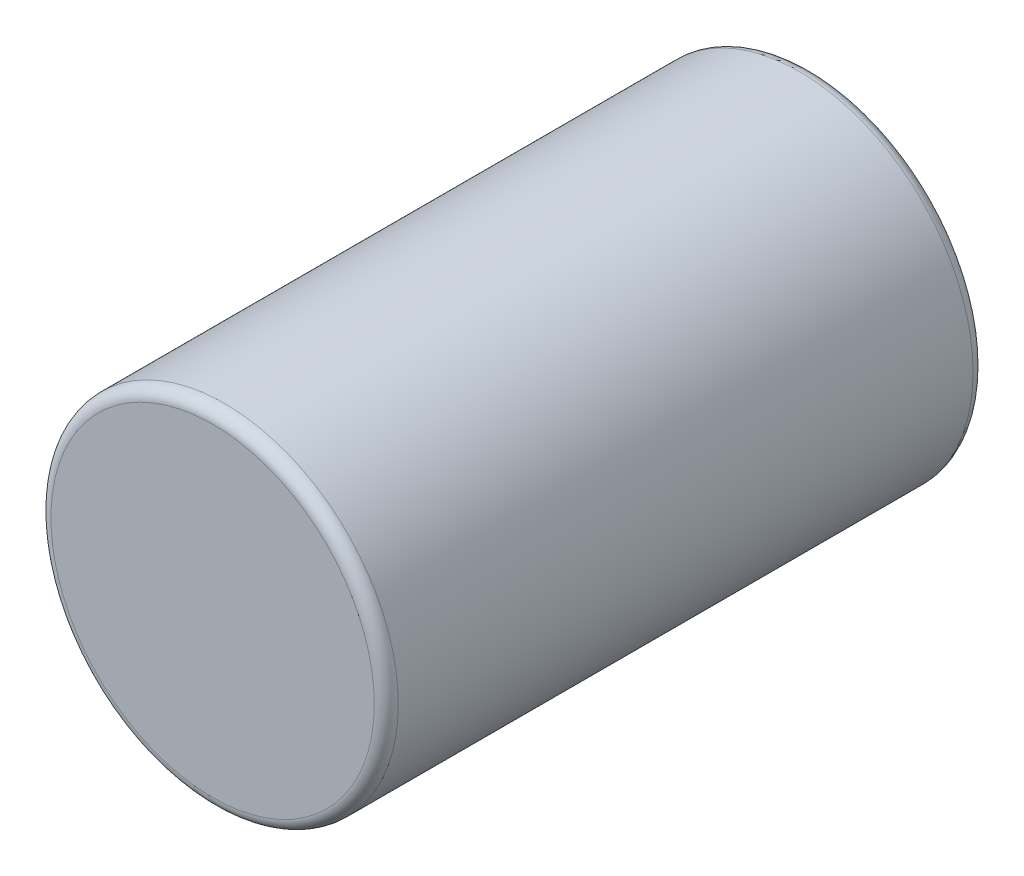
ISO-10303-21;
HEADER;
FILE_DESCRIPTION(('STEP AP214'),'2;1');
FILE_NAME('part.step','',(''),(''),'','','');
FILE_SCHEMA(('AUTOMOTIVE_DESIGN { 1 0 10303 214 1 1 1 1 }'));
ENDSEC;
DATA;
#1=APPLICATION_CONTEXT('core data for automotive mechanical design processes');
#2=APPLICATION_PROTOCOL_DEFINITION('international standard','automotive_design',2000,#1);
#3=PRODUCT_CONTEXT('',#1,'mechanical');
#4=PRODUCT('Part','Part','',(#3));
#5=PRODUCT_RELATED_PRODUCT_CATEGORY('part','',(#4));
#6=PRODUCT_DEFINITION_FORMATION('','',#4);
#7=PRODUCT_DEFINITION_CONTEXT('part definition',#1,'design');
#8=PRODUCT_DEFINITION('design','',#6,#7);
#9=PRODUCT_DEFINITION_SHAPE('','',#8);
#10=(LENGTH_UNIT() NAMED_UNIT(*) SI_UNIT(.MILLI.,.METRE.));
#11=(NAMED_UNIT(*) PLANE_ANGLE_UNIT() SI_UNIT($,.RADIAN.));
#12=(NAMED_UNIT(*) SI_UNIT($,.STERADIAN.) SOLID_ANGLE_UNIT());
#13=UNCERTAINTY_MEASURE_WITH_UNIT(LENGTH_MEASURE(1.E-05),#10,'distance_accuracy_value','');
#14=(GEOMETRIC_REPRESENTATION_CONTEXT(3) GLOBAL_UNCERTAINTY_ASSIGNED_CONTEXT((#13)) GLOBAL_UNIT_ASSIGNED_CONTEXT((#10,
#11,#12)) REPRESENTATION_CONTEXT('',''));
#15=CARTESIAN_POINT('',(0.,0.,0.));
#16=DIRECTION('',(0.,0.,1.));
#17=DIRECTION('',(1.,0.,0.));
#18=AXIS2_PLACEMENT_3D('',#15,#16,#17);
#19=CARTESIAN_POINT('',(0.,0.,2.5));
#20=DIRECTION('',(0.,0.,-1.));
#21=DIRECTION('',(-1.,0.,0.));
#22=AXIS2_PLACEMENT_3D('',#19,#20,#21);
#23=CYLINDRICAL_SURFACE('',#22,0.725);
#24=CARTESIAN_POINT('',(0.,0.,0.0500000000000001));
#25=DIRECTION('',(0.,0.,1.));
#26=DIRECTION('',(1.,0.,0.));
#27=AXIS2_PLACEMENT_3D('',#24,#25,#26);
#28=CIRCLE('',#27,0.725);
#29=CARTESIAN_POINT('',(0.725,0.,0.0500000000000001));
#30=VERTEX_POINT('',#29);
#31=EDGE_CURVE('E44',#30,#30,#28,.T.);
#32=ORIENTED_EDGE('',*,*,#31,.T.);
#33=EDGE_LOOP('',(#32));
#34=FACE_BOUND('',#33,.T.);
#35=CARTESIAN_POINT('',(0.,0.,2.45));
#36=DIRECTION('',(0.,0.,1.));
#37=DIRECTION('',(1.,0.,0.));
#38=AXIS2_PLACEMENT_3D('',#35,#36,#37);
#39=CIRCLE('',#38,0.725);
#40=CARTESIAN_POINT('',(0.725,0.,2.45));
#41=VERTEX_POINT('',#40);
#42=EDGE_CURVE('E48',#41,#41,#39,.F.);
#43=ORIENTED_EDGE('',*,*,#42,.T.);
#44=EDGE_LOOP('',(#43));
#45=FACE_BOUND('',#44,.T.);
#46=ADVANCED_FACE('F33',(#34,#45),#23,.T.);
#47=CARTESIAN_POINT('',(0.,0.,2.5));
#48=DIRECTION('',(0.,0.,1.));
#49=DIRECTION('',(1.,0.,0.));
#50=AXIS2_PLACEMENT_3D('',#47,#48,#49);
#51=PLANE('',#50);
#52=CARTESIAN_POINT('',(0.,0.,2.5));
#53=DIRECTION('',(0.,0.,1.));
#54=DIRECTION('',(1.,0.,0.));
#55=AXIS2_PLACEMENT_3D('',#52,#53,#54);
#56=CIRCLE('',#55,0.675);
#57=CARTESIAN_POINT('',(0.675,0.,2.5));
#58=VERTEX_POINT('',#57);
#59=EDGE_CURVE('E10',#58,#58,#56,.T.);
#60=ORIENTED_EDGE('',*,*,#59,.T.);
#61=EDGE_LOOP('',(#60));
#62=FACE_BOUND('',#61,.T.);
#63=ADVANCED_FACE('F64',(#62),#51,.T.);
#64=CARTESIAN_POINT('',(0.,0.,0.));
#65=DIRECTION('',(0.,0.,1.));
#66=DIRECTION('',(1.,0.,0.));
#67=AXIS2_PLACEMENT_3D('',#64,#65,#66);
#68=PLANE('',#67);
#69=CARTESIAN_POINT('',(0.,0.,0.));
#70=DIRECTION('',(0.,0.,1.));
#71=DIRECTION('',(1.,0.,0.));
#72=AXIS2_PLACEMENT_3D('',#69,#70,#71);
#73=CIRCLE('',#72,0.675);
#74=CARTESIAN_POINT('',(0.675,0.,0.));
#75=VERTEX_POINT('',#74);
#76=EDGE_CURVE('E40',#75,#75,#73,.F.);
#77=ORIENTED_EDGE('',*,*,#76,.T.);
#78=EDGE_LOOP('',(#77));
#79=FACE_BOUND('',#78,.T.);
#80=ADVANCED_FACE('F61',(#79),#68,.F.);
#81=CARTESIAN_POINT('',(0.,0.,0.0500000000000001));
#82=DIRECTION('',(0.,0.,1.));
#83=DIRECTION('',(1.,0.,0.));
#84=AXIS2_PLACEMENT_3D('',#81,#82,#83);
#85=TOROIDAL_SURFACE('',#84,0.675,0.05);
#86=ORIENTED_EDGE('',*,*,#76,.F.);
#87=EDGE_LOOP('',(#86));
#88=FACE_BOUND('',#87,.T.);
#89=ORIENTED_EDGE('',*,*,#31,.F.);
#90=EDGE_LOOP('',(#89));
#91=FACE_BOUND('',#90,.T.);
#92=ADVANCED_FACE('F57',(#88,#91),#85,.T.);
#93=CARTESIAN_POINT('',(0.,0.,2.45));
#94=DIRECTION('',(0.,0.,1.));
#95=DIRECTION('',(1.,0.,0.));
#96=AXIS2_PLACEMENT_3D('',#93,#94,#95);
#97=TOROIDAL_SURFACE('',#96,0.675,0.05);
#98=ORIENTED_EDGE('',*,*,#42,.F.);
#99=EDGE_LOOP('',(#98));
#100=FACE_BOUND('',#99,.T.);
#101=ORIENTED_EDGE('',*,*,#59,.F.);
#102=EDGE_LOOP('',(#101));
#103=FACE_BOUND('',#102,.T.);
#104=ADVANCED_FACE('F35',(#100,#103),#97,.T.);
#105=CLOSED_SHELL('',(#46,#63,#80,#92,#104));
#106=MANIFOLD_SOLID_BREP('B2',#105);
#107=ADVANCED_BREP_SHAPE_REPRESENTATION('',(#18,#106),#14);
#108=SHAPE_DEFINITION_REPRESENTATION(#9,#107);
ENDSEC;
END-ISO-10303-21;
